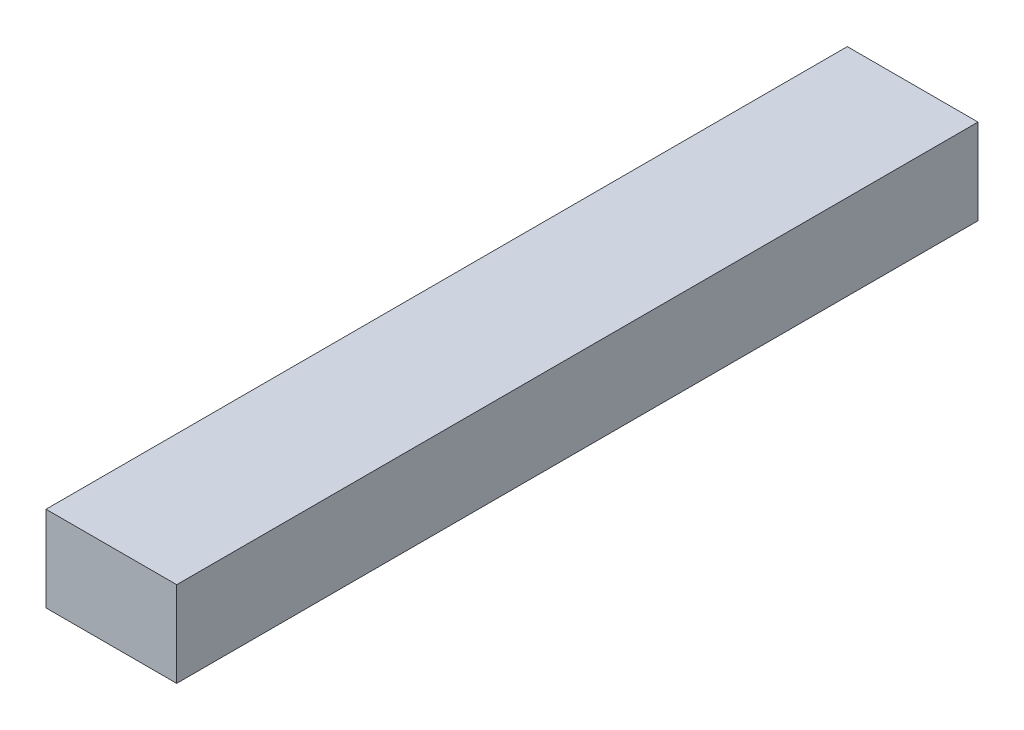
ISO-10303-21;
HEADER;
FILE_DESCRIPTION(('STEP AP214'),'2;1');
FILE_NAME('part.step','',(''),(''),'','','');
FILE_SCHEMA(('AUTOMOTIVE_DESIGN { 1 0 10303 214 1 1 1 1 }'));
ENDSEC;
DATA;
#1=APPLICATION_CONTEXT('core data for automotive mechanical design processes');
#2=APPLICATION_PROTOCOL_DEFINITION('international standard','automotive_design',2000,#1);
#3=PRODUCT_CONTEXT('',#1,'mechanical');
#4=PRODUCT('Part','Part','',(#3));
#5=PRODUCT_RELATED_PRODUCT_CATEGORY('part','',(#4));
#6=PRODUCT_DEFINITION_FORMATION('','',#4);
#7=PRODUCT_DEFINITION_CONTEXT('part definition',#1,'design');
#8=PRODUCT_DEFINITION('design','',#6,#7);
#9=PRODUCT_DEFINITION_SHAPE('','',#8);
#10=(LENGTH_UNIT() NAMED_UNIT(*) SI_UNIT(.MILLI.,.METRE.));
#11=(NAMED_UNIT(*) PLANE_ANGLE_UNIT() SI_UNIT($,.RADIAN.));
#12=(NAMED_UNIT(*) SI_UNIT($,.STERADIAN.) SOLID_ANGLE_UNIT());
#13=UNCERTAINTY_MEASURE_WITH_UNIT(LENGTH_MEASURE(1.E-05),#10,'distance_accuracy_value','');
#14=(GEOMETRIC_REPRESENTATION_CONTEXT(3) GLOBAL_UNCERTAINTY_ASSIGNED_CONTEXT((#13)) GLOBAL_UNIT_ASSIGNED_CONTEXT((#10,
#11,#12)) REPRESENTATION_CONTEXT('',''));
#15=CARTESIAN_POINT('',(0.,0.,0.));
#16=DIRECTION('',(0.,0.,1.));
#17=DIRECTION('',(1.,0.,0.));
#18=AXIS2_PLACEMENT_3D('',#15,#16,#17);
#19=CARTESIAN_POINT('',(0.,0.,206.));
#20=DIRECTION('',(1.,0.,0.));
#21=DIRECTION('',(0.,0.,-1.));
#22=AXIS2_PLACEMENT_3D('',#19,#20,#21);
#23=PLANE('',#22);
#24=DIRECTION('',(0.,-1.,0.));
#25=VECTOR('',#24,1.);
#26=CARTESIAN_POINT('',(0.,0.,0.));
#27=LINE('',#26,#25);
#28=CARTESIAN_POINT('',(0.,21.98,0.));
#29=VERTEX_POINT('',#28);
#30=CARTESIAN_POINT('',(0.,0.,0.));
#31=VERTEX_POINT('',#30);
#32=EDGE_CURVE('E96',#29,#31,#27,.T.);
#33=ORIENTED_EDGE('',*,*,#32,.T.);
#34=DIRECTION('',(0.,0.,-1.));
#35=VECTOR('',#34,1.);
#36=CARTESIAN_POINT('',(0.,0.,206.));
#37=LINE('',#36,#35);
#38=CARTESIAN_POINT('',(0.,0.,206.));
#39=VERTEX_POINT('',#38);
#40=EDGE_CURVE('E11',#39,#31,#37,.T.);
#41=ORIENTED_EDGE('',*,*,#40,.F.);
#42=DIRECTION('',(0.,-1.,0.));
#43=VECTOR('',#42,1.);
#44=CARTESIAN_POINT('',(0.,0.,206.));
#45=LINE('',#44,#43);
#46=CARTESIAN_POINT('',(0.,21.98,206.));
#47=VERTEX_POINT('',#46);
#48=EDGE_CURVE('E84',#47,#39,#45,.T.);
#49=ORIENTED_EDGE('',*,*,#48,.F.);
#50=DIRECTION('',(0.,0.,-1.));
#51=VECTOR('',#50,1.);
#52=CARTESIAN_POINT('',(0.,21.98,206.));
#53=LINE('',#52,#51);
#54=EDGE_CURVE('E92',#47,#29,#53,.T.);
#55=ORIENTED_EDGE('',*,*,#54,.T.);
#56=EDGE_LOOP('',(#33,#41,#49,#55));
#57=FACE_BOUND('',#56,.T.);
#58=ADVANCED_FACE('F33',(#57),#23,.F.);
#59=CARTESIAN_POINT('',(0.,0.,206.));
#60=DIRECTION('',(0.,1.,0.));
#61=DIRECTION('',(0.,0.,1.));
#62=AXIS2_PLACEMENT_3D('',#59,#60,#61);
#63=PLANE('',#62);
#64=DIRECTION('',(1.,0.,0.));
#65=VECTOR('',#64,1.);
#66=CARTESIAN_POINT('',(0.,0.,0.));
#67=LINE('',#66,#65);
#68=CARTESIAN_POINT('',(33.6,0.,0.));
#69=VERTEX_POINT('',#68);
#70=EDGE_CURVE('E88',#31,#69,#67,.T.);
#71=ORIENTED_EDGE('',*,*,#70,.T.);
#72=DIRECTION('',(0.,0.,-1.));
#73=VECTOR('',#72,1.);
#74=CARTESIAN_POINT('',(33.6,0.,206.));
#75=LINE('',#74,#73);
#76=CARTESIAN_POINT('',(33.6,0.,206.));
#77=VERTEX_POINT('',#76);
#78=EDGE_CURVE('E41',#77,#69,#75,.T.);
#79=ORIENTED_EDGE('',*,*,#78,.F.);
#80=DIRECTION('',(1.,0.,0.));
#81=VECTOR('',#80,1.);
#82=CARTESIAN_POINT('',(0.,0.,206.));
#83=LINE('',#82,#81);
#84=EDGE_CURVE('E79',#39,#77,#83,.T.);
#85=ORIENTED_EDGE('',*,*,#84,.F.);
#86=ORIENTED_EDGE('',*,*,#40,.T.);
#87=EDGE_LOOP('',(#71,#79,#85,#86));
#88=FACE_BOUND('',#87,.T.);
#89=ADVANCED_FACE('F87',(#88),#63,.F.);
#90=CARTESIAN_POINT('',(33.6,0.,206.));
#91=DIRECTION('',(-1.,0.,0.));
#92=DIRECTION('',(0.,0.,1.));
#93=AXIS2_PLACEMENT_3D('',#90,#91,#92);
#94=PLANE('',#93);
#95=DIRECTION('',(0.,1.,0.));
#96=VECTOR('',#95,1.);
#97=CARTESIAN_POINT('',(33.6,0.,0.));
#98=LINE('',#97,#96);
#99=CARTESIAN_POINT('',(33.6,21.98,0.));
#100=VERTEX_POINT('',#99);
#101=EDGE_CURVE('E66',#69,#100,#98,.T.);
#102=ORIENTED_EDGE('',*,*,#101,.T.);
#103=DIRECTION('',(0.,0.,-1.));
#104=VECTOR('',#103,1.);
#105=CARTESIAN_POINT('',(33.6,21.98,206.));
#106=LINE('',#105,#104);
#107=CARTESIAN_POINT('',(33.6,21.98,206.));
#108=VERTEX_POINT('',#107);
#109=EDGE_CURVE('E89',#108,#100,#106,.T.);
#110=ORIENTED_EDGE('',*,*,#109,.F.);
#111=DIRECTION('',(0.,1.,0.));
#112=VECTOR('',#111,1.);
#113=CARTESIAN_POINT('',(33.6,0.,206.));
#114=LINE('',#113,#112);
#115=EDGE_CURVE('E82',#77,#108,#114,.T.);
#116=ORIENTED_EDGE('',*,*,#115,.F.);
#117=ORIENTED_EDGE('',*,*,#78,.T.);
#118=EDGE_LOOP('',(#102,#110,#116,#117));
#119=FACE_BOUND('',#118,.T.);
#120=ADVANCED_FACE('F90',(#119),#94,.F.);
#121=CARTESIAN_POINT('',(0.,21.98,206.));
#122=DIRECTION('',(0.,-1.,0.));
#123=DIRECTION('',(0.,0.,-1.));
#124=AXIS2_PLACEMENT_3D('',#121,#122,#123);
#125=PLANE('',#124);
#126=DIRECTION('',(-1.,0.,0.));
#127=VECTOR('',#126,1.);
#128=CARTESIAN_POINT('',(0.,21.98,0.));
#129=LINE('',#128,#127);
#130=EDGE_CURVE('E72',#100,#29,#129,.T.);
#131=ORIENTED_EDGE('',*,*,#130,.T.);
#132=ORIENTED_EDGE('',*,*,#54,.F.);
#133=DIRECTION('',(-1.,0.,0.));
#134=VECTOR('',#133,1.);
#135=CARTESIAN_POINT('',(0.,21.98,206.));
#136=LINE('',#135,#134);
#137=EDGE_CURVE('E49',#108,#47,#136,.T.);
#138=ORIENTED_EDGE('',*,*,#137,.F.);
#139=ORIENTED_EDGE('',*,*,#109,.T.);
#140=EDGE_LOOP('',(#131,#132,#138,#139));
#141=FACE_BOUND('',#140,.T.);
#142=ADVANCED_FACE('F103',(#141),#125,.F.);
#143=CARTESIAN_POINT('',(0.,21.98,206.));
#144=DIRECTION('',(0.,0.,-1.));
#145=DIRECTION('',(-1.,0.,0.));
#146=AXIS2_PLACEMENT_3D('',#143,#144,#145);
#147=PLANE('',#146);
#148=ORIENTED_EDGE('',*,*,#48,.T.);
#149=ORIENTED_EDGE('',*,*,#84,.T.);
#150=ORIENTED_EDGE('',*,*,#115,.T.);
#151=ORIENTED_EDGE('',*,*,#137,.T.);
#152=EDGE_LOOP('',(#148,#149,#150,#151));
#153=FACE_BOUND('',#152,.T.);
#154=ADVANCED_FACE('F80',(#153),#147,.F.);
#155=CARTESIAN_POINT('',(0.,21.98,0.));
#156=DIRECTION('',(0.,0.,-1.));
#157=DIRECTION('',(-1.,0.,0.));
#158=AXIS2_PLACEMENT_3D('',#155,#156,#157);
#159=PLANE('',#158);
#160=ORIENTED_EDGE('',*,*,#32,.F.);
#161=ORIENTED_EDGE('',*,*,#130,.F.);
#162=ORIENTED_EDGE('',*,*,#101,.F.);
#163=ORIENTED_EDGE('',*,*,#70,.F.);
#164=EDGE_LOOP('',(#160,#161,#162,#163));
#165=FACE_BOUND('',#164,.T.);
#166=ADVANCED_FACE('F106',(#165),#159,.T.);
#167=CLOSED_SHELL('',(#58,#89,#120,#142,#154,#166));
#168=MANIFOLD_SOLID_BREP('B2',#167);
#169=ADVANCED_BREP_SHAPE_REPRESENTATION('',(#18,#168),#14);
#170=SHAPE_DEFINITION_REPRESENTATION(#9,#169);
ENDSEC;
END-ISO-10303-21;
